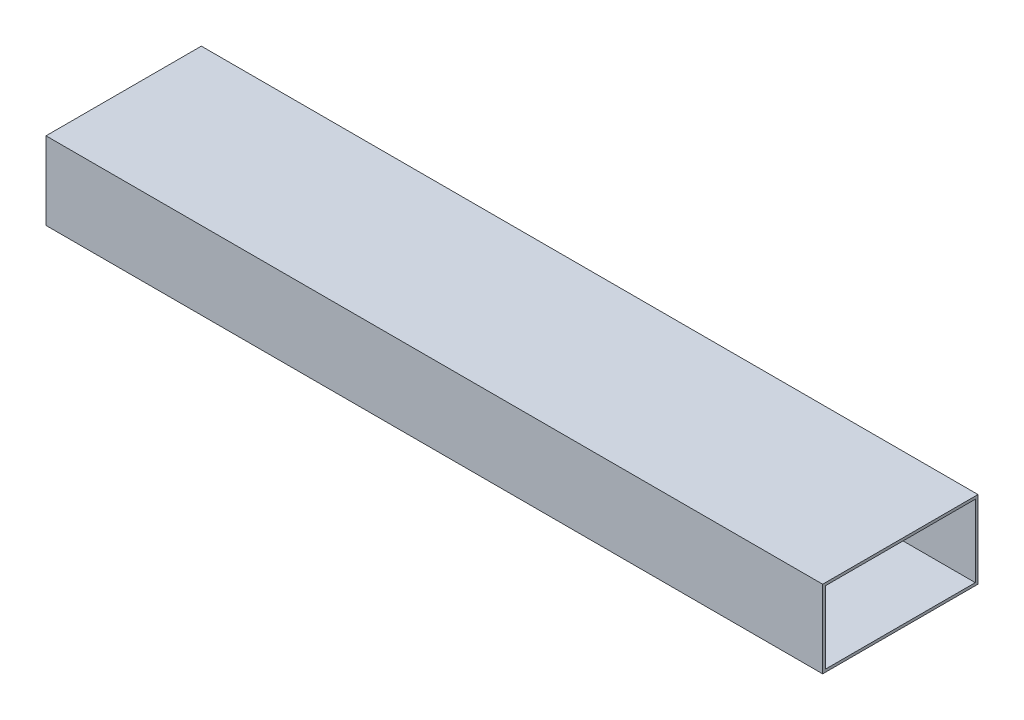
ISO-10303-21;
HEADER;
FILE_DESCRIPTION(('STEP AP214'),'2;1');
FILE_NAME('part.step','',(''),(''),'','','');
FILE_SCHEMA(('AUTOMOTIVE_DESIGN { 1 0 10303 214 1 1 1 1 }'));
ENDSEC;
DATA;
#1=APPLICATION_CONTEXT('core data for automotive mechanical design processes');
#2=APPLICATION_PROTOCOL_DEFINITION('international standard','automotive_design',2000,#1);
#3=PRODUCT_CONTEXT('',#1,'mechanical');
#4=PRODUCT('Part','Part','',(#3));
#5=PRODUCT_RELATED_PRODUCT_CATEGORY('part','',(#4));
#6=PRODUCT_DEFINITION_FORMATION('','',#4);
#7=PRODUCT_DEFINITION_CONTEXT('part definition',#1,'design');
#8=PRODUCT_DEFINITION('design','',#6,#7);
#9=PRODUCT_DEFINITION_SHAPE('','',#8);
#10=(LENGTH_UNIT() NAMED_UNIT(*) SI_UNIT(.MILLI.,.METRE.));
#11=(NAMED_UNIT(*) PLANE_ANGLE_UNIT() SI_UNIT($,.RADIAN.));
#12=(NAMED_UNIT(*) SI_UNIT($,.STERADIAN.) SOLID_ANGLE_UNIT());
#13=UNCERTAINTY_MEASURE_WITH_UNIT(LENGTH_MEASURE(1.E-05),#10,'distance_accuracy_value','');
#14=(GEOMETRIC_REPRESENTATION_CONTEXT(3) GLOBAL_UNCERTAINTY_ASSIGNED_CONTEXT((#13)) GLOBAL_UNIT_ASSIGNED_CONTEXT((#10,
#11,#12)) REPRESENTATION_CONTEXT('',''));
#15=CARTESIAN_POINT('',(0.,0.,0.));
#16=DIRECTION('',(0.,0.,1.));
#17=DIRECTION('',(1.,0.,0.));
#18=AXIS2_PLACEMENT_3D('',#15,#16,#17);
#19=CARTESIAN_POINT('',(127.,0.,0.));
#20=DIRECTION('',(-1.,0.,0.));
#21=DIRECTION('',(0.,0.,1.));
#22=AXIS2_PLACEMENT_3D('',#19,#20,#21);
#23=PLANE('',#22);
#24=DIRECTION('',(0.,1.,0.));
#25=VECTOR('',#24,1.);
#26=CARTESIAN_POINT('',(127.,-12.7,-25.4));
#27=LINE('',#26,#25);
#28=CARTESIAN_POINT('',(127.,-12.7,-25.4));
#29=VERTEX_POINT('',#28);
#30=CARTESIAN_POINT('',(127.,12.7,-25.4));
#31=VERTEX_POINT('',#30);
#32=EDGE_CURVE('E139',#29,#31,#27,.T.);
#33=ORIENTED_EDGE('',*,*,#32,.T.);
#34=DIRECTION('',(0.,0.,1.));
#35=VECTOR('',#34,1.);
#36=CARTESIAN_POINT('',(127.,12.7,25.4));
#37=LINE('',#36,#35);
#38=CARTESIAN_POINT('',(127.,12.7,25.4));
#39=VERTEX_POINT('',#38);
#40=EDGE_CURVE('E142',#31,#39,#37,.T.);
#41=ORIENTED_EDGE('',*,*,#40,.T.);
#42=DIRECTION('',(0.,-1.,0.));
#43=VECTOR('',#42,1.);
#44=CARTESIAN_POINT('',(127.,-12.7,25.4));
#45=LINE('',#44,#43);
#46=CARTESIAN_POINT('',(127.,-12.7,25.4));
#47=VERTEX_POINT('',#46);
#48=EDGE_CURVE('E145',#39,#47,#45,.T.);
#49=ORIENTED_EDGE('',*,*,#48,.T.);
#50=DIRECTION('',(0.,0.,-1.));
#51=VECTOR('',#50,1.);
#52=CARTESIAN_POINT('',(127.,-12.7,25.4));
#53=LINE('',#52,#51);
#54=EDGE_CURVE('E147',#47,#29,#53,.T.);
#55=ORIENTED_EDGE('',*,*,#54,.T.);
#56=EDGE_LOOP('',(#33,#41,#49,#55));
#57=FACE_BOUND('',#56,.T.);
#58=DIRECTION('',(0.,0.,-1.));
#59=VECTOR('',#58,1.);
#60=CARTESIAN_POINT('',(127.,-11.811,24.511));
#61=LINE('',#60,#59);
#62=CARTESIAN_POINT('',(127.,-11.811,24.511));
#63=VERTEX_POINT('',#62);
#64=CARTESIAN_POINT('',(127.,-11.811,-24.511));
#65=VERTEX_POINT('',#64);
#66=EDGE_CURVE('E103',#63,#65,#61,.T.);
#67=ORIENTED_EDGE('',*,*,#66,.F.);
#68=DIRECTION('',(0.,-1.,0.));
#69=VECTOR('',#68,1.);
#70=CARTESIAN_POINT('',(127.,-11.811,24.511));
#71=LINE('',#70,#69);
#72=CARTESIAN_POINT('',(127.,11.811,24.511));
#73=VERTEX_POINT('',#72);
#74=EDGE_CURVE('E125',#73,#63,#71,.T.);
#75=ORIENTED_EDGE('',*,*,#74,.F.);
#76=DIRECTION('',(0.,0.,1.));
#77=VECTOR('',#76,1.);
#78=CARTESIAN_POINT('',(127.,11.811,24.511));
#79=LINE('',#78,#77);
#80=CARTESIAN_POINT('',(127.,11.811,-24.511));
#81=VERTEX_POINT('',#80);
#82=EDGE_CURVE('E123',#81,#73,#79,.T.);
#83=ORIENTED_EDGE('',*,*,#82,.F.);
#84=DIRECTION('',(0.,1.,0.));
#85=VECTOR('',#84,1.);
#86=CARTESIAN_POINT('',(127.,-11.811,-24.511));
#87=LINE('',#86,#85);
#88=EDGE_CURVE('E111',#65,#81,#87,.T.);
#89=ORIENTED_EDGE('',*,*,#88,.F.);
#90=EDGE_LOOP('',(#67,#75,#83,#89));
#91=FACE_BOUND('',#90,.T.);
#92=ADVANCED_FACE('F38',(#57,#91),#23,.F.);
#93=CARTESIAN_POINT('',(-127.,0.,0.));
#94=DIRECTION('',(-1.,0.,0.));
#95=DIRECTION('',(0.,0.,1.));
#96=AXIS2_PLACEMENT_3D('',#93,#94,#95);
#97=PLANE('',#96);
#98=DIRECTION('',(0.,1.,0.));
#99=VECTOR('',#98,1.);
#100=CARTESIAN_POINT('',(-127.,-12.7,-25.4));
#101=LINE('',#100,#99);
#102=CARTESIAN_POINT('',(-127.,-12.7,-25.4));
#103=VERTEX_POINT('',#102);
#104=CARTESIAN_POINT('',(-127.,12.7,-25.4));
#105=VERTEX_POINT('',#104);
#106=EDGE_CURVE('E119',#103,#105,#101,.T.);
#107=ORIENTED_EDGE('',*,*,#106,.F.);
#108=DIRECTION('',(0.,0.,-1.));
#109=VECTOR('',#108,1.);
#110=CARTESIAN_POINT('',(-127.,-12.7,25.4));
#111=LINE('',#110,#109);
#112=CARTESIAN_POINT('',(-127.,-12.7,25.4));
#113=VERTEX_POINT('',#112);
#114=EDGE_CURVE('E143',#113,#103,#111,.T.);
#115=ORIENTED_EDGE('',*,*,#114,.F.);
#116=DIRECTION('',(0.,-1.,0.));
#117=VECTOR('',#116,1.);
#118=CARTESIAN_POINT('',(-127.,-12.7,25.4));
#119=LINE('',#118,#117);
#120=CARTESIAN_POINT('',(-127.,12.7,25.4));
#121=VERTEX_POINT('',#120);
#122=EDGE_CURVE('E154',#121,#113,#119,.T.);
#123=ORIENTED_EDGE('',*,*,#122,.F.);
#124=DIRECTION('',(0.,0.,1.));
#125=VECTOR('',#124,1.);
#126=CARTESIAN_POINT('',(-127.,12.7,25.4));
#127=LINE('',#126,#125);
#128=EDGE_CURVE('E152',#105,#121,#127,.T.);
#129=ORIENTED_EDGE('',*,*,#128,.F.);
#130=EDGE_LOOP('',(#107,#115,#123,#129));
#131=FACE_BOUND('',#130,.T.);
#132=DIRECTION('',(0.,-1.,0.));
#133=VECTOR('',#132,1.);
#134=CARTESIAN_POINT('',(-127.,-11.811,24.511));
#135=LINE('',#134,#133);
#136=CARTESIAN_POINT('',(-127.,11.811,24.511));
#137=VERTEX_POINT('',#136);
#138=CARTESIAN_POINT('',(-127.,-11.811,24.511));
#139=VERTEX_POINT('',#138);
#140=EDGE_CURVE('E112',#137,#139,#135,.T.);
#141=ORIENTED_EDGE('',*,*,#140,.T.);
#142=DIRECTION('',(0.,0.,-1.));
#143=VECTOR('',#142,1.);
#144=CARTESIAN_POINT('',(-127.,-11.811,24.511));
#145=LINE('',#144,#143);
#146=CARTESIAN_POINT('',(-127.,-11.811,-24.511));
#147=VERTEX_POINT('',#146);
#148=EDGE_CURVE('E61',#139,#147,#145,.T.);
#149=ORIENTED_EDGE('',*,*,#148,.T.);
#150=DIRECTION('',(0.,1.,0.));
#151=VECTOR('',#150,1.);
#152=CARTESIAN_POINT('',(-127.,-11.811,-24.511));
#153=LINE('',#152,#151);
#154=CARTESIAN_POINT('',(-127.,11.811,-24.511));
#155=VERTEX_POINT('',#154);
#156=EDGE_CURVE('E118',#147,#155,#153,.T.);
#157=ORIENTED_EDGE('',*,*,#156,.T.);
#158=DIRECTION('',(0.,0.,1.));
#159=VECTOR('',#158,1.);
#160=CARTESIAN_POINT('',(-127.,11.811,24.511));
#161=LINE('',#160,#159);
#162=EDGE_CURVE('E131',#155,#137,#161,.T.);
#163=ORIENTED_EDGE('',*,*,#162,.T.);
#164=EDGE_LOOP('',(#141,#149,#157,#163));
#165=FACE_BOUND('',#164,.T.);
#166=ADVANCED_FACE('F172',(#131,#165),#97,.T.);
#167=CARTESIAN_POINT('',(127.,-12.7,-25.4));
#168=DIRECTION('',(0.,0.,1.));
#169=DIRECTION('',(1.,0.,0.));
#170=AXIS2_PLACEMENT_3D('',#167,#168,#169);
#171=PLANE('',#170);
#172=ORIENTED_EDGE('',*,*,#106,.T.);
#173=DIRECTION('',(-1.,0.,0.));
#174=VECTOR('',#173,1.);
#175=CARTESIAN_POINT('',(127.,12.7,-25.4));
#176=LINE('',#175,#174);
#177=EDGE_CURVE('E11',#31,#105,#176,.T.);
#178=ORIENTED_EDGE('',*,*,#177,.F.);
#179=ORIENTED_EDGE('',*,*,#32,.F.);
#180=DIRECTION('',(-1.,0.,0.));
#181=VECTOR('',#180,1.);
#182=CARTESIAN_POINT('',(127.,-12.7,-25.4));
#183=LINE('',#182,#181);
#184=EDGE_CURVE('E149',#29,#103,#183,.T.);
#185=ORIENTED_EDGE('',*,*,#184,.T.);
#186=EDGE_LOOP('',(#172,#178,#179,#185));
#187=FACE_BOUND('',#186,.T.);
#188=ADVANCED_FACE('F40',(#187),#171,.F.);
#189=CARTESIAN_POINT('',(127.,12.7,25.4));
#190=DIRECTION('',(0.,-1.,0.));
#191=DIRECTION('',(0.,0.,-1.));
#192=AXIS2_PLACEMENT_3D('',#189,#190,#191);
#193=PLANE('',#192);
#194=ORIENTED_EDGE('',*,*,#128,.T.);
#195=DIRECTION('',(-1.,0.,0.));
#196=VECTOR('',#195,1.);
#197=CARTESIAN_POINT('',(127.,12.7,25.4));
#198=LINE('',#197,#196);
#199=EDGE_CURVE('E46',#39,#121,#198,.T.);
#200=ORIENTED_EDGE('',*,*,#199,.F.);
#201=ORIENTED_EDGE('',*,*,#40,.F.);
#202=ORIENTED_EDGE('',*,*,#177,.T.);
#203=EDGE_LOOP('',(#194,#200,#201,#202));
#204=FACE_BOUND('',#203,.T.);
#205=ADVANCED_FACE('F182',(#204),#193,.F.);
#206=CARTESIAN_POINT('',(127.,-12.7,25.4));
#207=DIRECTION('',(0.,0.,-1.));
#208=DIRECTION('',(-1.,0.,0.));
#209=AXIS2_PLACEMENT_3D('',#206,#207,#208);
#210=PLANE('',#209);
#211=ORIENTED_EDGE('',*,*,#122,.T.);
#212=DIRECTION('',(-1.,0.,0.));
#213=VECTOR('',#212,1.);
#214=CARTESIAN_POINT('',(127.,-12.7,25.4));
#215=LINE('',#214,#213);
#216=EDGE_CURVE('E159',#47,#113,#215,.T.);
#217=ORIENTED_EDGE('',*,*,#216,.F.);
#218=ORIENTED_EDGE('',*,*,#48,.F.);
#219=ORIENTED_EDGE('',*,*,#199,.T.);
#220=EDGE_LOOP('',(#211,#217,#218,#219));
#221=FACE_BOUND('',#220,.T.);
#222=ADVANCED_FACE('F166',(#221),#210,.F.);
#223=CARTESIAN_POINT('',(127.,-12.7,25.4));
#224=DIRECTION('',(0.,1.,0.));
#225=DIRECTION('',(0.,0.,1.));
#226=AXIS2_PLACEMENT_3D('',#223,#224,#225);
#227=PLANE('',#226);
#228=ORIENTED_EDGE('',*,*,#114,.T.);
#229=ORIENTED_EDGE('',*,*,#184,.F.);
#230=ORIENTED_EDGE('',*,*,#54,.F.);
#231=ORIENTED_EDGE('',*,*,#216,.T.);
#232=EDGE_LOOP('',(#228,#229,#230,#231));
#233=FACE_BOUND('',#232,.T.);
#234=ADVANCED_FACE('F176',(#233),#227,.F.);
#235=CARTESIAN_POINT('',(127.,-11.811,24.511));
#236=DIRECTION('',(0.,1.,0.));
#237=DIRECTION('',(0.,0.,1.));
#238=AXIS2_PLACEMENT_3D('',#235,#236,#237);
#239=PLANE('',#238);
#240=ORIENTED_EDGE('',*,*,#148,.F.);
#241=DIRECTION('',(-1.,0.,0.));
#242=VECTOR('',#241,1.);
#243=CARTESIAN_POINT('',(127.,-11.811,24.511));
#244=LINE('',#243,#242);
#245=EDGE_CURVE('E107',#63,#139,#244,.T.);
#246=ORIENTED_EDGE('',*,*,#245,.F.);
#247=ORIENTED_EDGE('',*,*,#66,.T.);
#248=DIRECTION('',(-1.,0.,0.));
#249=VECTOR('',#248,1.);
#250=CARTESIAN_POINT('',(127.,-11.811,-24.511));
#251=LINE('',#250,#249);
#252=EDGE_CURVE('E106',#65,#147,#251,.T.);
#253=ORIENTED_EDGE('',*,*,#252,.T.);
#254=EDGE_LOOP('',(#240,#246,#247,#253));
#255=FACE_BOUND('',#254,.T.);
#256=ADVANCED_FACE('F105',(#255),#239,.T.);
#257=CARTESIAN_POINT('',(127.,-11.811,-24.511));
#258=DIRECTION('',(0.,0.,1.));
#259=DIRECTION('',(1.,0.,0.));
#260=AXIS2_PLACEMENT_3D('',#257,#258,#259);
#261=PLANE('',#260);
#262=ORIENTED_EDGE('',*,*,#156,.F.);
#263=ORIENTED_EDGE('',*,*,#252,.F.);
#264=ORIENTED_EDGE('',*,*,#88,.T.);
#265=DIRECTION('',(-1.,0.,0.));
#266=VECTOR('',#265,1.);
#267=CARTESIAN_POINT('',(127.,11.811,-24.511));
#268=LINE('',#267,#266);
#269=EDGE_CURVE('E120',#81,#155,#268,.T.);
#270=ORIENTED_EDGE('',*,*,#269,.T.);
#271=EDGE_LOOP('',(#262,#263,#264,#270));
#272=FACE_BOUND('',#271,.T.);
#273=ADVANCED_FACE('F115',(#272),#261,.T.);
#274=CARTESIAN_POINT('',(127.,11.811,24.511));
#275=DIRECTION('',(0.,-1.,0.));
#276=DIRECTION('',(0.,0.,-1.));
#277=AXIS2_PLACEMENT_3D('',#274,#275,#276);
#278=PLANE('',#277);
#279=ORIENTED_EDGE('',*,*,#162,.F.);
#280=ORIENTED_EDGE('',*,*,#269,.F.);
#281=ORIENTED_EDGE('',*,*,#82,.T.);
#282=DIRECTION('',(-1.,0.,0.));
#283=VECTOR('',#282,1.);
#284=CARTESIAN_POINT('',(127.,11.811,24.511));
#285=LINE('',#284,#283);
#286=EDGE_CURVE('E53',#73,#137,#285,.T.);
#287=ORIENTED_EDGE('',*,*,#286,.T.);
#288=EDGE_LOOP('',(#279,#280,#281,#287));
#289=FACE_BOUND('',#288,.T.);
#290=ADVANCED_FACE('F205',(#289),#278,.T.);
#291=CARTESIAN_POINT('',(127.,-11.811,24.511));
#292=DIRECTION('',(0.,0.,-1.));
#293=DIRECTION('',(-1.,0.,0.));
#294=AXIS2_PLACEMENT_3D('',#291,#292,#293);
#295=PLANE('',#294);
#296=ORIENTED_EDGE('',*,*,#140,.F.);
#297=ORIENTED_EDGE('',*,*,#286,.F.);
#298=ORIENTED_EDGE('',*,*,#74,.T.);
#299=ORIENTED_EDGE('',*,*,#245,.T.);
#300=EDGE_LOOP('',(#296,#297,#298,#299));
#301=FACE_BOUND('',#300,.T.);
#302=ADVANCED_FACE('F209',(#301),#295,.T.);
#303=CLOSED_SHELL('',(#92,#166,#188,#205,#222,#234,#256,#273,#290,#302));
#304=MANIFOLD_SOLID_BREP('B2',#303);
#305=ADVANCED_BREP_SHAPE_REPRESENTATION('',(#18,#304),#14);
#306=SHAPE_DEFINITION_REPRESENTATION(#9,#305);
ENDSEC;
END-ISO-10303-21;
